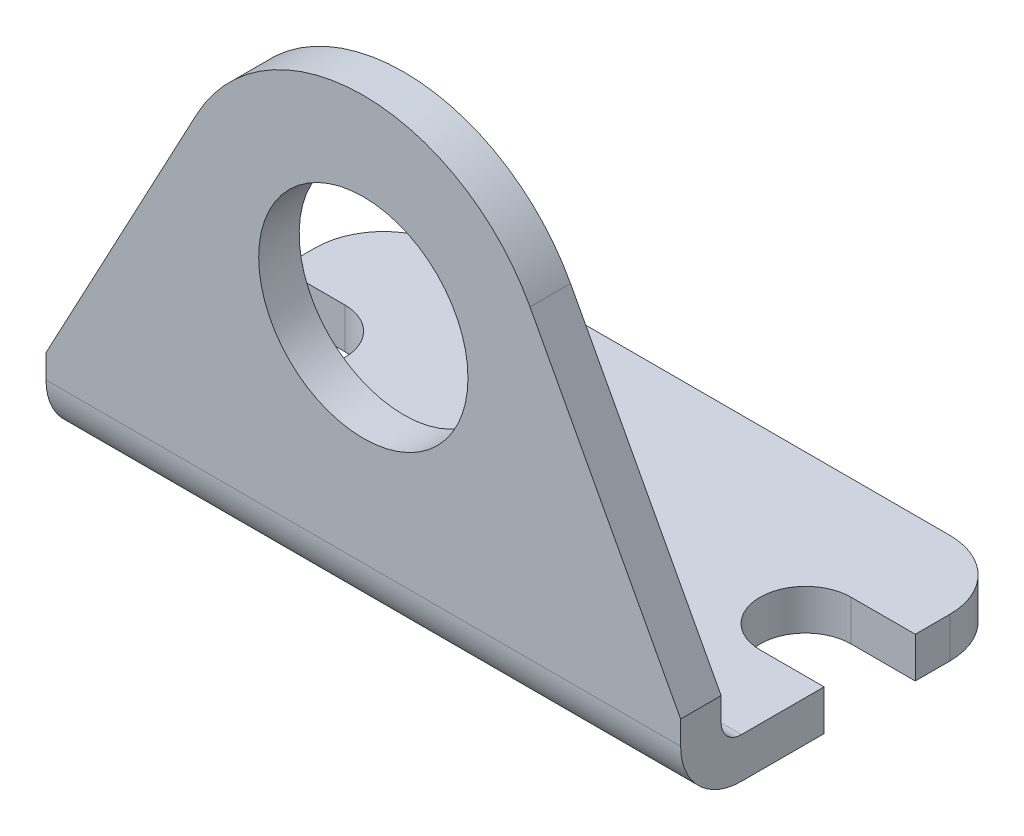
ISO-10303-21;
HEADER;
FILE_DESCRIPTION(('STEP AP214'),'2;1');
FILE_NAME('part.step','',(''),(''),'','','');
FILE_SCHEMA(('AUTOMOTIVE_DESIGN { 1 0 10303 214 1 1 1 1 }'));
ENDSEC;
DATA;
#1=APPLICATION_CONTEXT('core data for automotive mechanical design processes');
#2=APPLICATION_PROTOCOL_DEFINITION('international standard','automotive_design',2000,#1);
#3=PRODUCT_CONTEXT('',#1,'mechanical');
#4=PRODUCT('Part','Part','',(#3));
#5=PRODUCT_RELATED_PRODUCT_CATEGORY('part','',(#4));
#6=PRODUCT_DEFINITION_FORMATION('','',#4);
#7=PRODUCT_DEFINITION_CONTEXT('part definition',#1,'design');
#8=PRODUCT_DEFINITION('design','',#6,#7);
#9=PRODUCT_DEFINITION_SHAPE('','',#8);
#10=(LENGTH_UNIT() NAMED_UNIT(*) SI_UNIT(.MILLI.,.METRE.));
#11=(NAMED_UNIT(*) PLANE_ANGLE_UNIT() SI_UNIT($,.RADIAN.));
#12=(NAMED_UNIT(*) SI_UNIT($,.STERADIAN.) SOLID_ANGLE_UNIT());
#13=UNCERTAINTY_MEASURE_WITH_UNIT(LENGTH_MEASURE(1.E-05),#10,'distance_accuracy_value','');
#14=(GEOMETRIC_REPRESENTATION_CONTEXT(3) GLOBAL_UNCERTAINTY_ASSIGNED_CONTEXT((#13)) GLOBAL_UNIT_ASSIGNED_CONTEXT((#10,
#11,#12)) REPRESENTATION_CONTEXT('',''));
#15=CARTESIAN_POINT('',(0.,0.,0.));
#16=DIRECTION('',(0.,0.,1.));
#17=DIRECTION('',(1.,0.,0.));
#18=AXIS2_PLACEMENT_3D('',#15,#16,#17);
#19=CARTESIAN_POINT('',(-23.876,0.,14.224));
#20=DIRECTION('',(0.,1.,0.));
#21=DIRECTION('',(0.,0.,1.));
#22=AXIS2_PLACEMENT_3D('',#19,#20,#21);
#23=PLANE('',#22);
#24=DIRECTION('',(0.,0.,-1.));
#25=VECTOR('',#24,1.);
#26=CARTESIAN_POINT('',(-23.876,0.,14.224));
#27=LINE('',#26,#25);
#28=CARTESIAN_POINT('',(-23.876,0.,-3.429));
#29=VERTEX_POINT('',#28);
#30=CARTESIAN_POINT('',(-23.876,0.,-6.0325));
#31=VERTEX_POINT('',#30);
#32=EDGE_CURVE('E201',#29,#31,#27,.T.);
#33=ORIENTED_EDGE('',*,*,#32,.T.);
#34=CARTESIAN_POINT('',(-18.7325,0.,-6.0325));
#35=DIRECTION('',(0.,1.,0.));
#36=DIRECTION('',(0.,0.,1.));
#37=AXIS2_PLACEMENT_3D('',#34,#35,#36);
#38=CIRCLE('',#37,5.1435);
#39=CARTESIAN_POINT('',(-18.7325,0.,-11.176));
#40=VERTEX_POINT('',#39);
#41=EDGE_CURVE('E224',#31,#40,#38,.F.);
#42=ORIENTED_EDGE('',*,*,#41,.T.);
#43=DIRECTION('',(1.,0.,0.));
#44=VECTOR('',#43,1.);
#45=CARTESIAN_POINT('',(-23.876,0.,-11.176));
#46=LINE('',#45,#44);
#47=CARTESIAN_POINT('',(18.7325,0.,-11.176));
#48=VERTEX_POINT('',#47);
#49=EDGE_CURVE('E247',#40,#48,#46,.T.);
#50=ORIENTED_EDGE('',*,*,#49,.T.);
#51=CARTESIAN_POINT('',(18.7325,0.,-6.0325));
#52=DIRECTION('',(0.,1.,0.));
#53=DIRECTION('',(0.,0.,1.));
#54=AXIS2_PLACEMENT_3D('',#51,#52,#53);
#55=CIRCLE('',#54,5.1435);
#56=CARTESIAN_POINT('',(23.876,0.,-6.0325));
#57=VERTEX_POINT('',#56);
#58=EDGE_CURVE('E222',#48,#57,#55,.F.);
#59=ORIENTED_EDGE('',*,*,#58,.T.);
#60=DIRECTION('',(0.,0.,-1.));
#61=VECTOR('',#60,1.);
#62=CARTESIAN_POINT('',(23.876,0.,14.224));
#63=LINE('',#62,#61);
#64=CARTESIAN_POINT('',(23.876,0.,-3.429));
#65=VERTEX_POINT('',#64);
#66=EDGE_CURVE('E202',#65,#57,#63,.T.);
#67=ORIENTED_EDGE('',*,*,#66,.F.);
#68=DIRECTION('',(-1.,0.,0.));
#69=VECTOR('',#68,1.);
#70=CARTESIAN_POINT('',(19.05,0.,-3.429));
#71=LINE('',#70,#69);
#72=CARTESIAN_POINT('',(19.05,0.,-3.429));
#73=VERTEX_POINT('',#72);
#74=EDGE_CURVE('E326',#65,#73,#71,.T.);
#75=ORIENTED_EDGE('',*,*,#74,.T.);
#76=CARTESIAN_POINT('',(19.05,0.,0.));
#77=DIRECTION('',(0.,1.,0.));
#78=DIRECTION('',(0.,0.,1.));
#79=AXIS2_PLACEMENT_3D('',#76,#77,#78);
#80=CIRCLE('',#79,3.429);
#81=CARTESIAN_POINT('',(19.05,0.,3.429));
#82=VERTEX_POINT('',#81);
#83=EDGE_CURVE('E323',#73,#82,#80,.T.);
#84=ORIENTED_EDGE('',*,*,#83,.T.);
#85=DIRECTION('',(1.,0.,0.));
#86=VECTOR('',#85,1.);
#87=CARTESIAN_POINT('',(19.05,0.,3.429));
#88=LINE('',#87,#86);
#89=CARTESIAN_POINT('',(23.876,0.,3.429));
#90=VERTEX_POINT('',#89);
#91=EDGE_CURVE('E200',#82,#90,#88,.T.);
#92=ORIENTED_EDGE('',*,*,#91,.T.);
#93=CARTESIAN_POINT('',(23.876,0.,9.652));
#94=VERTEX_POINT('',#93);
#95=EDGE_CURVE('E191',#94,#90,#63,.T.);
#96=ORIENTED_EDGE('',*,*,#95,.F.);
#97=DIRECTION('',(-1.,0.,0.));
#98=VECTOR('',#97,1.);
#99=CARTESIAN_POINT('',(23.876,0.,9.652));
#100=LINE('',#99,#98);
#101=CARTESIAN_POINT('',(-23.876,0.,9.652));
#102=VERTEX_POINT('',#101);
#103=EDGE_CURVE('E174',#94,#102,#100,.T.);
#104=ORIENTED_EDGE('',*,*,#103,.T.);
#105=CARTESIAN_POINT('',(-23.876,0.,3.429));
#106=VERTEX_POINT('',#105);
#107=EDGE_CURVE('E204',#102,#106,#27,.T.);
#108=ORIENTED_EDGE('',*,*,#107,.T.);
#109=DIRECTION('',(1.,0.,0.));
#110=VECTOR('',#109,1.);
#111=CARTESIAN_POINT('',(-19.05,0.,3.429));
#112=LINE('',#111,#110);
#113=CARTESIAN_POINT('',(-19.05,0.,3.429));
#114=VERTEX_POINT('',#113);
#115=EDGE_CURVE('E339',#106,#114,#112,.T.);
#116=ORIENTED_EDGE('',*,*,#115,.T.);
#117=CARTESIAN_POINT('',(-19.05,0.,0.));
#118=DIRECTION('',(0.,1.,0.));
#119=DIRECTION('',(0.,0.,1.));
#120=AXIS2_PLACEMENT_3D('',#117,#118,#119);
#121=CIRCLE('',#120,3.429);
#122=CARTESIAN_POINT('',(-19.05,0.,-3.429));
#123=VERTEX_POINT('',#122);
#124=EDGE_CURVE('E342',#114,#123,#121,.T.);
#125=ORIENTED_EDGE('',*,*,#124,.T.);
#126=DIRECTION('',(-1.,0.,0.));
#127=VECTOR('',#126,1.);
#128=CARTESIAN_POINT('',(-19.05,0.,-3.429));
#129=LINE('',#128,#127);
#130=EDGE_CURVE('E337',#123,#29,#129,.T.);
#131=ORIENTED_EDGE('',*,*,#130,.T.);
#132=EDGE_LOOP('',(#33,#42,#50,#59,#67,#75,#84,#92,#96,#104,#108,#116,#125,#131));
#133=FACE_BOUND('',#132,.T.);
#134=ADVANCED_FACE('F36',(#133),#23,.F.);
#135=CARTESIAN_POINT('',(0.,20.828,14.224));
#136=DIRECTION('',(0.,0.,1.));
#137=DIRECTION('',(1.,0.,0.));
#138=AXIS2_PLACEMENT_3D('',#135,#136,#137);
#139=PLANE('',#138);
#140=CARTESIAN_POINT('',(0.,20.574,14.224));
#141=DIRECTION('',(0.,0.,1.));
#142=DIRECTION('',(1.,0.,0.));
#143=AXIS2_PLACEMENT_3D('',#140,#141,#142);
#144=CIRCLE('',#143,7.874);
#145=CARTESIAN_POINT('',(7.874,20.574,14.224));
#146=VERTEX_POINT('',#145);
#147=EDGE_CURVE('E251',#146,#146,#144,.T.);
#148=ORIENTED_EDGE('',*,*,#147,.F.);
#149=EDGE_LOOP('',(#148));
#150=FACE_BOUND('',#149,.T.);
#151=DIRECTION('',(0.,-1.,0.));
#152=VECTOR('',#151,1.);
#153=CARTESIAN_POINT('',(-23.876,6.35,14.224));
#154=LINE('',#153,#152);
#155=CARTESIAN_POINT('',(-23.876,6.35,14.224));
#156=VERTEX_POINT('',#155);
#157=CARTESIAN_POINT('',(-23.876,4.572,14.224));
#158=VERTEX_POINT('',#157);
#159=EDGE_CURVE('E254',#156,#158,#154,.T.);
#160=ORIENTED_EDGE('',*,*,#159,.T.);
#161=DIRECTION('',(-1.,0.,0.));
#162=VECTOR('',#161,1.);
#163=CARTESIAN_POINT('',(23.876,4.572,14.224));
#164=LINE('',#163,#162);
#165=CARTESIAN_POINT('',(23.876,4.572,14.224));
#166=VERTEX_POINT('',#165);
#167=EDGE_CURVE('E185',#166,#158,#164,.T.);
#168=ORIENTED_EDGE('',*,*,#167,.F.);
#169=DIRECTION('',(0.,1.,0.));
#170=VECTOR('',#169,1.);
#171=CARTESIAN_POINT('',(23.876,0.,14.224));
#172=LINE('',#171,#170);
#173=CARTESIAN_POINT('',(23.876,6.35,14.224));
#174=VERTEX_POINT('',#173);
#175=EDGE_CURVE('E194',#166,#174,#172,.T.);
#176=ORIENTED_EDGE('',*,*,#175,.T.);
#177=DIRECTION('',(-0.471685602568826,0.881766801557693,0.));
#178=VECTOR('',#177,1.);
#179=CARTESIAN_POINT('',(23.876,6.35,14.224));
#180=LINE('',#179,#178);
#181=CARTESIAN_POINT('',(12.5422509853566,27.537256010939,14.224));
#182=VERTEX_POINT('',#181);
#183=EDGE_CURVE('E263',#174,#182,#180,.T.);
#184=ORIENTED_EDGE('',*,*,#183,.T.);
#185=CARTESIAN_POINT('',(0.,20.828,14.224));
#186=DIRECTION('',(0.,0.,1.));
#187=DIRECTION('',(1.,0.,0.));
#188=AXIS2_PLACEMENT_3D('',#185,#186,#187);
#189=CIRCLE('',#188,14.224);
#190=CARTESIAN_POINT('',(-12.5422509853566,27.537256010939,14.224));
#191=VERTEX_POINT('',#190);
#192=EDGE_CURVE('E265',#182,#191,#189,.T.);
#193=ORIENTED_EDGE('',*,*,#192,.T.);
#194=DIRECTION('',(-0.471685602568826,-0.881766801557693,0.));
#195=VECTOR('',#194,1.);
#196=CARTESIAN_POINT('',(-12.5422509853566,27.537256010939,14.224));
#197=LINE('',#196,#195);
#198=EDGE_CURVE('E267',#191,#156,#197,.T.);
#199=ORIENTED_EDGE('',*,*,#198,.T.);
#200=EDGE_LOOP('',(#160,#168,#176,#184,#193,#199));
#201=FACE_BOUND('',#200,.T.);
#202=ADVANCED_FACE('F380',(#150,#201),#139,.T.);
#203=CARTESIAN_POINT('',(23.876,0.,14.224));
#204=DIRECTION('',(-1.,0.,0.));
#205=DIRECTION('',(0.,0.,1.));
#206=AXIS2_PLACEMENT_3D('',#203,#204,#205);
#207=PLANE('',#206);
#208=ORIENTED_EDGE('',*,*,#175,.F.);
#209=CARTESIAN_POINT('',(23.876,4.572,9.652));
#210=DIRECTION('',(1.,0.,0.));
#211=DIRECTION('',(0.,0.,1.));
#212=AXIS2_PLACEMENT_3D('',#209,#210,#211);
#213=CIRCLE('',#212,4.572);
#214=EDGE_CURVE('E177',#166,#94,#213,.T.);
#215=ORIENTED_EDGE('',*,*,#214,.T.);
#216=ORIENTED_EDGE('',*,*,#95,.T.);
#217=DIRECTION('',(0.,-1.,0.));
#218=VECTOR('',#217,1.);
#219=CARTESIAN_POINT('',(23.876,35.052,3.429));
#220=LINE('',#219,#218);
#221=CARTESIAN_POINT('',(23.876,3.048,3.429));
#222=VERTEX_POINT('',#221);
#223=EDGE_CURVE('E333',#222,#90,#220,.T.);
#224=ORIENTED_EDGE('',*,*,#223,.F.);
#225=DIRECTION('',(0.,0.,1.));
#226=VECTOR('',#225,1.);
#227=CARTESIAN_POINT('',(23.876,3.048,-11.176));
#228=LINE('',#227,#226);
#229=CARTESIAN_POINT('',(23.876,3.048,9.652));
#230=VERTEX_POINT('',#229);
#231=EDGE_CURVE('E304',#222,#230,#228,.T.);
#232=ORIENTED_EDGE('',*,*,#231,.T.);
#233=CARTESIAN_POINT('',(23.876,4.572,9.652));
#234=DIRECTION('',(-1.,0.,0.));
#235=DIRECTION('',(0.,0.,1.));
#236=AXIS2_PLACEMENT_3D('',#233,#234,#235);
#237=CIRCLE('',#236,1.524);
#238=CARTESIAN_POINT('',(23.876,4.572,11.176));
#239=VERTEX_POINT('',#238);
#240=EDGE_CURVE('E291',#230,#239,#237,.T.);
#241=ORIENTED_EDGE('',*,*,#240,.T.);
#242=DIRECTION('',(0.,1.,0.));
#243=VECTOR('',#242,1.);
#244=CARTESIAN_POINT('',(23.876,35.052,11.176));
#245=LINE('',#244,#243);
#246=CARTESIAN_POINT('',(23.876,6.34999999999999,11.176));
#247=VERTEX_POINT('',#246);
#248=EDGE_CURVE('E288',#239,#247,#245,.T.);
#249=ORIENTED_EDGE('',*,*,#248,.T.);
#250=DIRECTION('',(0.,0.,-1.));
#251=VECTOR('',#250,1.);
#252=CARTESIAN_POINT('',(23.876,6.35,14.224));
#253=LINE('',#252,#251);
#254=EDGE_CURVE('E207',#174,#247,#253,.T.);
#255=ORIENTED_EDGE('',*,*,#254,.F.);
#256=EDGE_LOOP('',(#208,#215,#216,#224,#232,#241,#249,#255));
#257=FACE_BOUND('',#256,.T.);
#258=ADVANCED_FACE('F189',(#257),#207,.F.);
#259=ORIENTED_EDGE('',*,*,#66,.T.);
#260=DIRECTION('',(0.,1.,0.));
#261=VECTOR('',#260,1.);
#262=CARTESIAN_POINT('',(23.876,0.,-6.0325));
#263=LINE('',#262,#261);
#264=CARTESIAN_POINT('',(23.876,3.048,-6.0325));
#265=VERTEX_POINT('',#264);
#266=EDGE_CURVE('E11',#57,#265,#263,.T.);
#267=ORIENTED_EDGE('',*,*,#266,.T.);
#268=CARTESIAN_POINT('',(23.876,3.048,-3.429));
#269=VERTEX_POINT('',#268);
#270=EDGE_CURVE('E296',#265,#269,#228,.T.);
#271=ORIENTED_EDGE('',*,*,#270,.T.);
#272=DIRECTION('',(0.,-1.,0.));
#273=VECTOR('',#272,1.);
#274=CARTESIAN_POINT('',(23.876,35.052,-3.429));
#275=LINE('',#274,#273);
#276=EDGE_CURVE('E331',#269,#65,#275,.T.);
#277=ORIENTED_EDGE('',*,*,#276,.T.);
#278=EDGE_LOOP('',(#259,#267,#271,#277));
#279=FACE_BOUND('',#278,.T.);
#280=ADVANCED_FACE('F400',(#279),#207,.F.);
#281=CARTESIAN_POINT('',(23.876,6.35,14.224));
#282=DIRECTION('',(-0.881766801557693,-0.471685602568826,0.));
#283=DIRECTION('',(0.471685602568826,-0.881766801557693,0.));
#284=AXIS2_PLACEMENT_3D('',#281,#282,#283);
#285=PLANE('',#284);
#286=ORIENTED_EDGE('',*,*,#254,.T.);
#287=DIRECTION('',(-0.471685602568826,0.881766801557693,0.));
#288=VECTOR('',#287,1.);
#289=CARTESIAN_POINT('',(23.876,6.35,11.176));
#290=LINE('',#289,#288);
#291=CARTESIAN_POINT('',(12.5422509853566,27.537256010939,11.176));
#292=VERTEX_POINT('',#291);
#293=EDGE_CURVE('E284',#247,#292,#290,.T.);
#294=ORIENTED_EDGE('',*,*,#293,.T.);
#295=DIRECTION('',(0.,0.,-1.));
#296=VECTOR('',#295,1.);
#297=CARTESIAN_POINT('',(12.5422509853566,27.537256010939,14.224));
#298=LINE('',#297,#296);
#299=EDGE_CURVE('E274',#182,#292,#298,.T.);
#300=ORIENTED_EDGE('',*,*,#299,.F.);
#301=ORIENTED_EDGE('',*,*,#183,.F.);
#302=EDGE_LOOP('',(#286,#294,#300,#301));
#303=FACE_BOUND('',#302,.T.);
#304=ADVANCED_FACE('F283',(#303),#285,.F.);
#305=CARTESIAN_POINT('',(-23.876,6.35,14.224));
#306=DIRECTION('',(1.,0.,0.));
#307=DIRECTION('',(0.,0.,-1.));
#308=AXIS2_PLACEMENT_3D('',#305,#306,#307);
#309=PLANE('',#308);
#310=DIRECTION('',(0.,0.,1.));
#311=VECTOR('',#310,1.);
#312=CARTESIAN_POINT('',(-23.876,3.048,-11.176));
#313=LINE('',#312,#311);
#314=CARTESIAN_POINT('',(-23.876,3.048,-6.0325));
#315=VERTEX_POINT('',#314);
#316=CARTESIAN_POINT('',(-23.876,3.048,-3.429));
#317=VERTEX_POINT('',#316);
#318=EDGE_CURVE('E233',#315,#317,#313,.T.);
#319=ORIENTED_EDGE('',*,*,#318,.F.);
#320=DIRECTION('',(0.,-1.,0.));
#321=VECTOR('',#320,1.);
#322=CARTESIAN_POINT('',(-23.876,6.35,-6.0325));
#323=LINE('',#322,#321);
#324=EDGE_CURVE('E214',#315,#31,#323,.T.);
#325=ORIENTED_EDGE('',*,*,#324,.T.);
#326=ORIENTED_EDGE('',*,*,#32,.F.);
#327=DIRECTION('',(0.,-1.,0.));
#328=VECTOR('',#327,1.);
#329=CARTESIAN_POINT('',(-23.876,35.052,-3.429));
#330=LINE('',#329,#328);
#331=EDGE_CURVE('E242',#317,#29,#330,.T.);
#332=ORIENTED_EDGE('',*,*,#331,.F.);
#333=EDGE_LOOP('',(#319,#325,#326,#332));
#334=FACE_BOUND('',#333,.T.);
#335=ADVANCED_FACE('F240',(#334),#309,.F.);
#336=ORIENTED_EDGE('',*,*,#107,.F.);
#337=CARTESIAN_POINT('',(-23.876,4.572,9.652));
#338=DIRECTION('',(1.,0.,0.));
#339=DIRECTION('',(0.,0.,1.));
#340=AXIS2_PLACEMENT_3D('',#337,#338,#339);
#341=CIRCLE('',#340,4.572);
#342=EDGE_CURVE('E180',#158,#102,#341,.T.);
#343=ORIENTED_EDGE('',*,*,#342,.F.);
#344=ORIENTED_EDGE('',*,*,#159,.F.);
#345=DIRECTION('',(0.,0.,-1.));
#346=VECTOR('',#345,1.);
#347=CARTESIAN_POINT('',(-23.876,6.35,14.224));
#348=LINE('',#347,#346);
#349=CARTESIAN_POINT('',(-23.876,6.35,11.176));
#350=VERTEX_POINT('',#349);
#351=EDGE_CURVE('E269',#156,#350,#348,.T.);
#352=ORIENTED_EDGE('',*,*,#351,.T.);
#353=DIRECTION('',(0.,1.,0.));
#354=VECTOR('',#353,1.);
#355=CARTESIAN_POINT('',(-23.876,35.052,11.176));
#356=LINE('',#355,#354);
#357=CARTESIAN_POINT('',(-23.876,4.572,11.176));
#358=VERTEX_POINT('',#357);
#359=EDGE_CURVE('E302',#358,#350,#356,.T.);
#360=ORIENTED_EDGE('',*,*,#359,.F.);
#361=CARTESIAN_POINT('',(-23.876,4.572,9.652));
#362=DIRECTION('',(-1.,0.,0.));
#363=DIRECTION('',(0.,0.,1.));
#364=AXIS2_PLACEMENT_3D('',#361,#362,#363);
#365=CIRCLE('',#364,1.524);
#366=CARTESIAN_POINT('',(-23.876,3.048,9.652));
#367=VERTEX_POINT('',#366);
#368=EDGE_CURVE('E243',#367,#358,#365,.T.);
#369=ORIENTED_EDGE('',*,*,#368,.F.);
#370=CARTESIAN_POINT('',(-23.876,3.048,3.429));
#371=VERTEX_POINT('',#370);
#372=EDGE_CURVE('E184',#371,#367,#313,.T.);
#373=ORIENTED_EDGE('',*,*,#372,.F.);
#374=DIRECTION('',(0.,-1.,0.));
#375=VECTOR('',#374,1.);
#376=CARTESIAN_POINT('',(-23.876,35.052,3.429));
#377=LINE('',#376,#375);
#378=EDGE_CURVE('E256',#371,#106,#377,.T.);
#379=ORIENTED_EDGE('',*,*,#378,.T.);
#380=EDGE_LOOP('',(#336,#343,#344,#352,#360,#369,#373,#379));
#381=FACE_BOUND('',#380,.T.);
#382=ADVANCED_FACE('F353',(#381),#309,.F.);
#383=CARTESIAN_POINT('',(-12.5422509853566,27.537256010939,14.224));
#384=DIRECTION('',(0.881766801557693,-0.471685602568826,0.));
#385=DIRECTION('',(0.471685602568826,0.881766801557693,0.));
#386=AXIS2_PLACEMENT_3D('',#383,#384,#385);
#387=PLANE('',#386);
#388=DIRECTION('',(0.,0.,-1.));
#389=VECTOR('',#388,1.);
#390=CARTESIAN_POINT('',(-12.5422509853566,27.537256010939,14.224));
#391=LINE('',#390,#389);
#392=CARTESIAN_POINT('',(-12.5422509853566,27.537256010939,11.176));
#393=VERTEX_POINT('',#392);
#394=EDGE_CURVE('E272',#191,#393,#391,.T.);
#395=ORIENTED_EDGE('',*,*,#394,.T.);
#396=DIRECTION('',(-0.471685602568826,-0.881766801557693,0.));
#397=VECTOR('',#396,1.);
#398=CARTESIAN_POINT('',(-12.5422509853566,27.537256010939,11.176));
#399=LINE('',#398,#397);
#400=EDGE_CURVE('E319',#393,#350,#399,.T.);
#401=ORIENTED_EDGE('',*,*,#400,.T.);
#402=ORIENTED_EDGE('',*,*,#351,.F.);
#403=ORIENTED_EDGE('',*,*,#198,.F.);
#404=EDGE_LOOP('',(#395,#401,#402,#403));
#405=FACE_BOUND('',#404,.T.);
#406=ADVANCED_FACE('F375',(#405),#387,.F.);
#407=CARTESIAN_POINT('',(0.,20.828,14.224));
#408=DIRECTION('',(0.,0.,-1.));
#409=DIRECTION('',(-1.,0.,0.));
#410=AXIS2_PLACEMENT_3D('',#407,#408,#409);
#411=CYLINDRICAL_SURFACE('',#410,14.224);
#412=CARTESIAN_POINT('',(0.,20.828,11.176));
#413=DIRECTION('',(0.,0.,1.));
#414=DIRECTION('',(0.,-1.,0.));
#415=AXIS2_PLACEMENT_3D('',#412,#413,#414);
#416=CIRCLE('',#415,14.224);
#417=EDGE_CURVE('E218',#292,#393,#416,.T.);
#418=ORIENTED_EDGE('',*,*,#417,.T.);
#419=ORIENTED_EDGE('',*,*,#394,.F.);
#420=ORIENTED_EDGE('',*,*,#192,.F.);
#421=ORIENTED_EDGE('',*,*,#299,.T.);
#422=EDGE_LOOP('',(#418,#419,#420,#421));
#423=FACE_BOUND('',#422,.T.);
#424=ADVANCED_FACE('F378',(#423),#411,.T.);
#425=CARTESIAN_POINT('',(0.,20.574,14.224));
#426=DIRECTION('',(0.,0.,-1.));
#427=DIRECTION('',(-1.,0.,0.));
#428=AXIS2_PLACEMENT_3D('',#425,#426,#427);
#429=CYLINDRICAL_SURFACE('',#428,7.874);
#430=CARTESIAN_POINT('',(0.,20.574,11.176));
#431=DIRECTION('',(0.,0.,1.));
#432=DIRECTION('',(0.,-1.,0.));
#433=AXIS2_PLACEMENT_3D('',#430,#431,#432);
#434=CIRCLE('',#433,7.874);
#435=CARTESIAN_POINT('',(0.,12.7,11.176));
#436=VERTEX_POINT('',#435);
#437=EDGE_CURVE('E215',#436,#436,#434,.T.);
#438=ORIENTED_EDGE('',*,*,#437,.F.);
#439=EDGE_LOOP('',(#438));
#440=FACE_BOUND('',#439,.T.);
#441=ORIENTED_EDGE('',*,*,#147,.T.);
#442=EDGE_LOOP('',(#441));
#443=FACE_BOUND('',#442,.T.);
#444=ADVANCED_FACE('F426',(#440,#443),#429,.F.);
#445=CARTESIAN_POINT('',(0.,20.828,-11.176));
#446=DIRECTION('',(0.,0.,1.));
#447=DIRECTION('',(1.,0.,0.));
#448=AXIS2_PLACEMENT_3D('',#445,#446,#447);
#449=PLANE('',#448);
#450=ORIENTED_EDGE('',*,*,#49,.F.);
#451=DIRECTION('',(0.,-1.,0.));
#452=VECTOR('',#451,1.);
#453=CARTESIAN_POINT('',(-18.7325,20.828,-11.176));
#454=LINE('',#453,#452);
#455=CARTESIAN_POINT('',(-18.7325,3.048,-11.176));
#456=VERTEX_POINT('',#455);
#457=EDGE_CURVE('E58',#40,#456,#454,.F.);
#458=ORIENTED_EDGE('',*,*,#457,.T.);
#459=DIRECTION('',(-1.,0.,0.));
#460=VECTOR('',#459,1.);
#461=CARTESIAN_POINT('',(23.876,3.048,-11.176));
#462=LINE('',#461,#460);
#463=CARTESIAN_POINT('',(18.7325,3.048,-11.176));
#464=VERTEX_POINT('',#463);
#465=EDGE_CURVE('E235',#464,#456,#462,.T.);
#466=ORIENTED_EDGE('',*,*,#465,.F.);
#467=DIRECTION('',(0.,1.,0.));
#468=VECTOR('',#467,1.);
#469=CARTESIAN_POINT('',(18.7325,20.828,-11.176));
#470=LINE('',#469,#468);
#471=EDGE_CURVE('E226',#464,#48,#470,.F.);
#472=ORIENTED_EDGE('',*,*,#471,.T.);
#473=EDGE_LOOP('',(#450,#458,#466,#472));
#474=FACE_BOUND('',#473,.T.);
#475=ADVANCED_FACE('F250',(#474),#449,.F.);
#476=CARTESIAN_POINT('',(-19.05,35.052,-3.429));
#477=DIRECTION('',(0.,0.,1.));
#478=DIRECTION('',(1.,0.,0.));
#479=AXIS2_PLACEMENT_3D('',#476,#477,#478);
#480=PLANE('',#479);
#481=DIRECTION('',(1.,0.,0.));
#482=VECTOR('',#481,1.);
#483=CARTESIAN_POINT('',(-19.05,3.048,-3.429));
#484=LINE('',#483,#482);
#485=CARTESIAN_POINT('',(-19.05,3.048,-3.429));
#486=VERTEX_POINT('',#485);
#487=EDGE_CURVE('E219',#317,#486,#484,.T.);
#488=ORIENTED_EDGE('',*,*,#487,.F.);
#489=ORIENTED_EDGE('',*,*,#331,.T.);
#490=ORIENTED_EDGE('',*,*,#130,.F.);
#491=DIRECTION('',(0.,-1.,0.));
#492=VECTOR('',#491,1.);
#493=CARTESIAN_POINT('',(-19.05,35.052,-3.429));
#494=LINE('',#493,#492);
#495=EDGE_CURVE('E345',#486,#123,#494,.T.);
#496=ORIENTED_EDGE('',*,*,#495,.F.);
#497=EDGE_LOOP('',(#488,#489,#490,#496));
#498=FACE_BOUND('',#497,.T.);
#499=ADVANCED_FACE('F366',(#498),#480,.T.);
#500=CARTESIAN_POINT('',(-19.05,35.052,3.429));
#501=DIRECTION('',(0.,0.,-1.));
#502=DIRECTION('',(-1.,0.,0.));
#503=AXIS2_PLACEMENT_3D('',#500,#501,#502);
#504=PLANE('',#503);
#505=DIRECTION('',(-1.,0.,0.));
#506=VECTOR('',#505,1.);
#507=CARTESIAN_POINT('',(-19.05,3.048,3.429));
#508=LINE('',#507,#506);
#509=CARTESIAN_POINT('',(-19.05,3.048,3.429));
#510=VERTEX_POINT('',#509);
#511=EDGE_CURVE('E315',#510,#371,#508,.T.);
#512=ORIENTED_EDGE('',*,*,#511,.F.);
#513=DIRECTION('',(0.,-1.,0.));
#514=VECTOR('',#513,1.);
#515=CARTESIAN_POINT('',(-19.05,35.052,3.429));
#516=LINE('',#515,#514);
#517=EDGE_CURVE('E347',#510,#114,#516,.T.);
#518=ORIENTED_EDGE('',*,*,#517,.T.);
#519=ORIENTED_EDGE('',*,*,#115,.F.);
#520=ORIENTED_EDGE('',*,*,#378,.F.);
#521=EDGE_LOOP('',(#512,#518,#519,#520));
#522=FACE_BOUND('',#521,.T.);
#523=ADVANCED_FACE('F357',(#522),#504,.T.);
#524=CARTESIAN_POINT('',(-19.05,35.052,0.));
#525=DIRECTION('',(0.,-1.,0.));
#526=DIRECTION('',(0.,0.,-1.));
#527=AXIS2_PLACEMENT_3D('',#524,#525,#526);
#528=CYLINDRICAL_SURFACE('',#527,3.429);
#529=CARTESIAN_POINT('',(-19.05,3.048,0.));
#530=DIRECTION('',(0.,-1.,0.));
#531=DIRECTION('',(0.,0.,-1.));
#532=AXIS2_PLACEMENT_3D('',#529,#530,#531);
#533=CIRCLE('',#532,3.429);
#534=EDGE_CURVE('E313',#486,#510,#533,.T.);
#535=ORIENTED_EDGE('',*,*,#534,.F.);
#536=ORIENTED_EDGE('',*,*,#495,.T.);
#537=ORIENTED_EDGE('',*,*,#124,.F.);
#538=ORIENTED_EDGE('',*,*,#517,.F.);
#539=EDGE_LOOP('',(#535,#536,#537,#538));
#540=FACE_BOUND('',#539,.T.);
#541=ADVANCED_FACE('F363',(#540),#528,.F.);
#542=CARTESIAN_POINT('',(19.05,35.052,0.));
#543=DIRECTION('',(0.,-1.,0.));
#544=DIRECTION('',(0.,0.,-1.));
#545=AXIS2_PLACEMENT_3D('',#542,#543,#544);
#546=CYLINDRICAL_SURFACE('',#545,3.429);
#547=CARTESIAN_POINT('',(19.05,3.048,0.));
#548=DIRECTION('',(0.,-1.,0.));
#549=DIRECTION('',(0.,0.,-1.));
#550=AXIS2_PLACEMENT_3D('',#547,#548,#549);
#551=CIRCLE('',#550,3.429);
#552=CARTESIAN_POINT('',(19.05,3.048,3.429));
#553=VERTEX_POINT('',#552);
#554=CARTESIAN_POINT('',(19.05,3.048,-3.429));
#555=VERTEX_POINT('',#554);
#556=EDGE_CURVE('E307',#553,#555,#551,.T.);
#557=ORIENTED_EDGE('',*,*,#556,.F.);
#558=DIRECTION('',(0.,-1.,0.));
#559=VECTOR('',#558,1.);
#560=CARTESIAN_POINT('',(19.05,35.052,3.429));
#561=LINE('',#560,#559);
#562=EDGE_CURVE('E335',#553,#82,#561,.T.);
#563=ORIENTED_EDGE('',*,*,#562,.T.);
#564=ORIENTED_EDGE('',*,*,#83,.F.);
#565=DIRECTION('',(0.,-1.,0.));
#566=VECTOR('',#565,1.);
#567=CARTESIAN_POINT('',(19.05,35.052,-3.429));
#568=LINE('',#567,#566);
#569=EDGE_CURVE('E329',#555,#73,#568,.T.);
#570=ORIENTED_EDGE('',*,*,#569,.F.);
#571=EDGE_LOOP('',(#557,#563,#564,#570));
#572=FACE_BOUND('',#571,.T.);
#573=ADVANCED_FACE('F392',(#572),#546,.F.);
#574=CARTESIAN_POINT('',(19.05,35.052,3.429));
#575=DIRECTION('',(0.,0.,-1.));
#576=DIRECTION('',(-1.,0.,0.));
#577=AXIS2_PLACEMENT_3D('',#574,#575,#576);
#578=PLANE('',#577);
#579=DIRECTION('',(-1.,0.,0.));
#580=VECTOR('',#579,1.);
#581=CARTESIAN_POINT('',(19.05,3.048,3.429));
#582=LINE('',#581,#580);
#583=EDGE_CURVE('E311',#222,#553,#582,.T.);
#584=ORIENTED_EDGE('',*,*,#583,.F.);
#585=ORIENTED_EDGE('',*,*,#223,.T.);
#586=ORIENTED_EDGE('',*,*,#91,.F.);
#587=ORIENTED_EDGE('',*,*,#562,.F.);
#588=EDGE_LOOP('',(#584,#585,#586,#587));
#589=FACE_BOUND('',#588,.T.);
#590=ADVANCED_FACE('F389',(#589),#578,.T.);
#591=CARTESIAN_POINT('',(19.05,35.052,-3.429));
#592=DIRECTION('',(0.,0.,1.));
#593=DIRECTION('',(1.,0.,0.));
#594=AXIS2_PLACEMENT_3D('',#591,#592,#593);
#595=PLANE('',#594);
#596=DIRECTION('',(1.,0.,0.));
#597=VECTOR('',#596,1.);
#598=CARTESIAN_POINT('',(19.05,3.048,-3.429));
#599=LINE('',#598,#597);
#600=EDGE_CURVE('E211',#555,#269,#599,.T.);
#601=ORIENTED_EDGE('',*,*,#600,.F.);
#602=ORIENTED_EDGE('',*,*,#569,.T.);
#603=ORIENTED_EDGE('',*,*,#74,.F.);
#604=ORIENTED_EDGE('',*,*,#276,.F.);
#605=EDGE_LOOP('',(#601,#602,#603,#604));
#606=FACE_BOUND('',#605,.T.);
#607=ADVANCED_FACE('F397',(#606),#595,.T.);
#608=CARTESIAN_POINT('',(23.876,35.052,11.176));
#609=DIRECTION('',(0.,0.,1.));
#610=DIRECTION('',(0.,-1.,0.));
#611=AXIS2_PLACEMENT_3D('',#608,#609,#610);
#612=PLANE('',#611);
#613=ORIENTED_EDGE('',*,*,#437,.T.);
#614=EDGE_LOOP('',(#613));
#615=FACE_BOUND('',#614,.T.);
#616=ORIENTED_EDGE('',*,*,#248,.F.);
#617=DIRECTION('',(-1.,0.,0.));
#618=VECTOR('',#617,1.);
#619=CARTESIAN_POINT('',(23.876,4.572,11.176));
#620=LINE('',#619,#618);
#621=EDGE_CURVE('E305',#239,#358,#620,.T.);
#622=ORIENTED_EDGE('',*,*,#621,.T.);
#623=ORIENTED_EDGE('',*,*,#359,.T.);
#624=ORIENTED_EDGE('',*,*,#400,.F.);
#625=ORIENTED_EDGE('',*,*,#417,.F.);
#626=ORIENTED_EDGE('',*,*,#293,.F.);
#627=EDGE_LOOP('',(#616,#622,#623,#624,#625,#626));
#628=FACE_BOUND('',#627,.T.);
#629=ADVANCED_FACE('F373',(#615,#628),#612,.F.);
#630=CARTESIAN_POINT('',(23.876,4.572,9.652));
#631=DIRECTION('',(-1.,0.,0.));
#632=DIRECTION('',(0.,0.,1.));
#633=AXIS2_PLACEMENT_3D('',#630,#631,#632);
#634=CYLINDRICAL_SURFACE('',#633,1.524);
#635=ORIENTED_EDGE('',*,*,#368,.T.);
#636=ORIENTED_EDGE('',*,*,#621,.F.);
#637=ORIENTED_EDGE('',*,*,#240,.F.);
#638=DIRECTION('',(-1.,0.,0.));
#639=VECTOR('',#638,1.);
#640=CARTESIAN_POINT('',(23.876,3.048,9.652));
#641=LINE('',#640,#639);
#642=EDGE_CURVE('E294',#230,#367,#641,.T.);
#643=ORIENTED_EDGE('',*,*,#642,.T.);
#644=EDGE_LOOP('',(#635,#636,#637,#643));
#645=FACE_BOUND('',#644,.T.);
#646=ADVANCED_FACE('F368',(#645),#634,.F.);
#647=CARTESIAN_POINT('',(23.876,3.048,-11.176));
#648=DIRECTION('',(0.,-1.,0.));
#649=DIRECTION('',(0.,0.,-1.));
#650=AXIS2_PLACEMENT_3D('',#647,#648,#649);
#651=PLANE('',#650);
#652=ORIENTED_EDGE('',*,*,#465,.T.);
#653=CARTESIAN_POINT('',(-18.7325,3.048,-6.0325));
#654=DIRECTION('',(0.,-1.,0.));
#655=DIRECTION('',(0.,0.,-1.));
#656=AXIS2_PLACEMENT_3D('',#653,#654,#655);
#657=CIRCLE('',#656,5.1435);
#658=EDGE_CURVE('E44',#456,#315,#657,.F.);
#659=ORIENTED_EDGE('',*,*,#658,.T.);
#660=ORIENTED_EDGE('',*,*,#318,.T.);
#661=ORIENTED_EDGE('',*,*,#487,.T.);
#662=ORIENTED_EDGE('',*,*,#534,.T.);
#663=ORIENTED_EDGE('',*,*,#511,.T.);
#664=ORIENTED_EDGE('',*,*,#372,.T.);
#665=ORIENTED_EDGE('',*,*,#642,.F.);
#666=ORIENTED_EDGE('',*,*,#231,.F.);
#667=ORIENTED_EDGE('',*,*,#583,.T.);
#668=ORIENTED_EDGE('',*,*,#556,.T.);
#669=ORIENTED_EDGE('',*,*,#600,.T.);
#670=ORIENTED_EDGE('',*,*,#270,.F.);
#671=CARTESIAN_POINT('',(18.7325,3.048,-6.0325));
#672=DIRECTION('',(0.,-1.,0.));
#673=DIRECTION('',(0.,0.,-1.));
#674=AXIS2_PLACEMENT_3D('',#671,#672,#673);
#675=CIRCLE('',#674,5.1435);
#676=EDGE_CURVE('E51',#265,#464,#675,.F.);
#677=ORIENTED_EDGE('',*,*,#676,.T.);
#678=EDGE_LOOP('',(#652,#659,#660,#661,#662,#663,#664,#665,#666,#667,#668,#669,#670,#677));
#679=FACE_BOUND('',#678,.T.);
#680=ADVANCED_FACE('F232',(#679),#651,.F.);
#681=CARTESIAN_POINT('',(23.876,4.572,9.652));
#682=DIRECTION('',(-1.,0.,0.));
#683=DIRECTION('',(0.,0.,1.));
#684=AXIS2_PLACEMENT_3D('',#681,#682,#683);
#685=CYLINDRICAL_SURFACE('',#684,4.572);
#686=ORIENTED_EDGE('',*,*,#342,.T.);
#687=ORIENTED_EDGE('',*,*,#103,.F.);
#688=ORIENTED_EDGE('',*,*,#214,.F.);
#689=ORIENTED_EDGE('',*,*,#167,.T.);
#690=EDGE_LOOP('',(#686,#687,#688,#689));
#691=FACE_BOUND('',#690,.T.);
#692=ADVANCED_FACE('F176',(#691),#685,.T.);
#693=CARTESIAN_POINT('',(-18.7325,6.35,-6.0325));
#694=DIRECTION('',(0.,-1.,0.));
#695=DIRECTION('',(0.,0.,-1.));
#696=AXIS2_PLACEMENT_3D('',#693,#694,#695);
#697=CYLINDRICAL_SURFACE('',#696,5.1435);
#698=ORIENTED_EDGE('',*,*,#658,.F.);
#699=ORIENTED_EDGE('',*,*,#457,.F.);
#700=ORIENTED_EDGE('',*,*,#41,.F.);
#701=ORIENTED_EDGE('',*,*,#324,.F.);
#702=EDGE_LOOP('',(#698,#699,#700,#701));
#703=FACE_BOUND('',#702,.T.);
#704=ADVANCED_FACE('F245',(#703),#697,.T.);
#705=CARTESIAN_POINT('',(18.7325,0.,-6.0325));
#706=DIRECTION('',(0.,1.,0.));
#707=DIRECTION('',(0.,0.,1.));
#708=AXIS2_PLACEMENT_3D('',#705,#706,#707);
#709=CYLINDRICAL_SURFACE('',#708,5.1435);
#710=ORIENTED_EDGE('',*,*,#58,.F.);
#711=ORIENTED_EDGE('',*,*,#471,.F.);
#712=ORIENTED_EDGE('',*,*,#676,.F.);
#713=ORIENTED_EDGE('',*,*,#266,.F.);
#714=EDGE_LOOP('',(#710,#711,#712,#713));
#715=FACE_BOUND('',#714,.T.);
#716=ADVANCED_FACE('F38',(#715),#709,.T.);
#717=CLOSED_SHELL('',(#134,#202,#258,#280,#304,#335,#382,#406,#424,#444,#475,#499,#523,#541,
#573,#590,#607,#629,#646,#680,#692,#704,#716));
#718=MANIFOLD_SOLID_BREP('B2',#717);
#719=ADVANCED_BREP_SHAPE_REPRESENTATION('',(#18,#718),#14);
#720=SHAPE_DEFINITION_REPRESENTATION(#9,#719);
ENDSEC;
END-ISO-10303-21;
